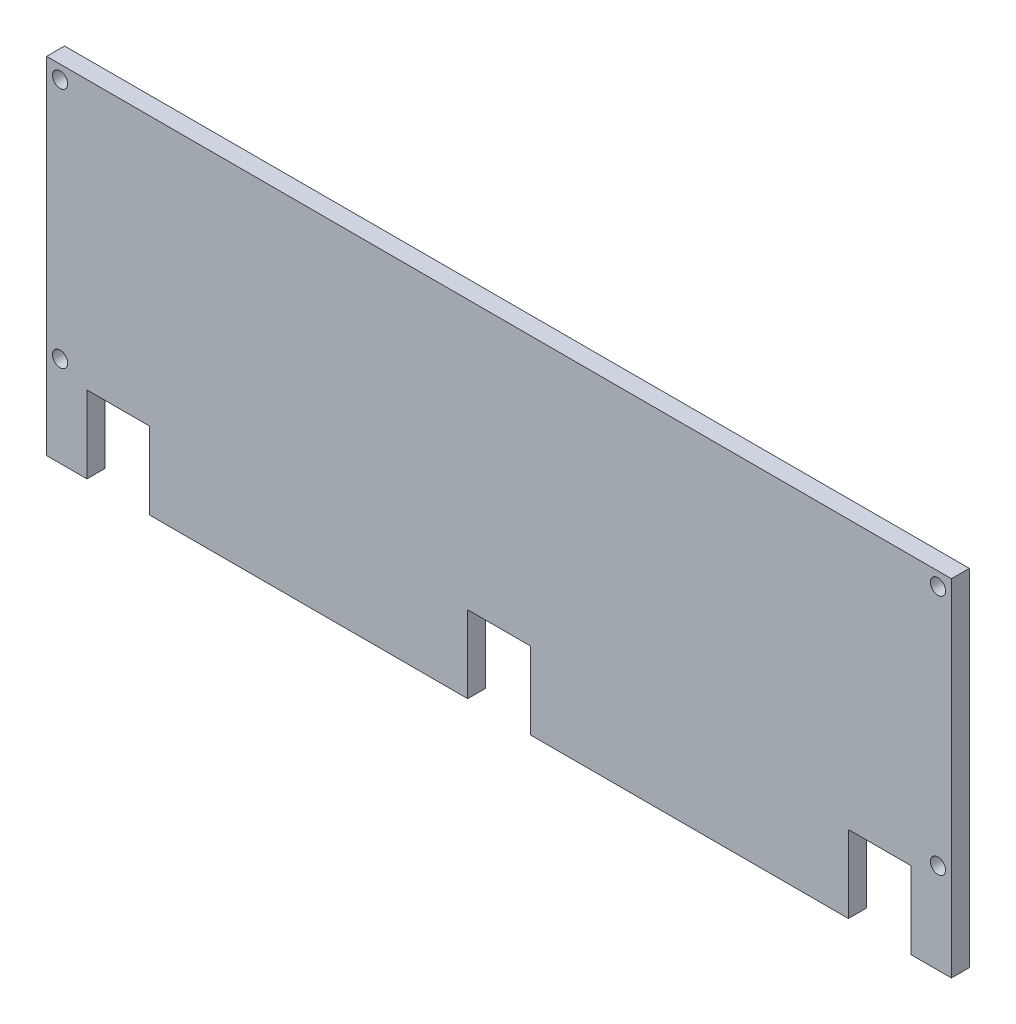
ISO-10303-21;
HEADER;
FILE_DESCRIPTION(('STEP AP214'),'2;1');
FILE_NAME('part.step','',(''),(''),'','','');
FILE_SCHEMA(('AUTOMOTIVE_DESIGN { 1 0 10303 214 1 1 1 1 }'));
ENDSEC;
DATA;
#1=APPLICATION_CONTEXT('core data for automotive mechanical design processes');
#2=APPLICATION_PROTOCOL_DEFINITION('international standard','automotive_design',2000,#1);
#3=PRODUCT_CONTEXT('',#1,'mechanical');
#4=PRODUCT('Part','Part','',(#3));
#5=PRODUCT_RELATED_PRODUCT_CATEGORY('part','',(#4));
#6=PRODUCT_DEFINITION_FORMATION('','',#4);
#7=PRODUCT_DEFINITION_CONTEXT('part definition',#1,'design');
#8=PRODUCT_DEFINITION('design','',#6,#7);
#9=PRODUCT_DEFINITION_SHAPE('','',#8);
#10=(LENGTH_UNIT() NAMED_UNIT(*) SI_UNIT(.MILLI.,.METRE.));
#11=(NAMED_UNIT(*) PLANE_ANGLE_UNIT() SI_UNIT($,.RADIAN.));
#12=(NAMED_UNIT(*) SI_UNIT($,.STERADIAN.) SOLID_ANGLE_UNIT());
#13=UNCERTAINTY_MEASURE_WITH_UNIT(LENGTH_MEASURE(1.E-05),#10,'distance_accuracy_value','');
#14=(GEOMETRIC_REPRESENTATION_CONTEXT(3) GLOBAL_UNCERTAINTY_ASSIGNED_CONTEXT((#13)) GLOBAL_UNIT_ASSIGNED_CONTEXT((#10,
#11,#12)) REPRESENTATION_CONTEXT('',''));
#15=CARTESIAN_POINT('',(0.,0.,0.));
#16=DIRECTION('',(0.,0.,1.));
#17=DIRECTION('',(1.,0.,0.));
#18=AXIS2_PLACEMENT_3D('',#15,#16,#17);
#19=CARTESIAN_POINT('',(-252.5,-75.,-10.));
#20=DIRECTION('',(0.,-1.,0.));
#21=DIRECTION('',(0.,0.,-1.));
#22=AXIS2_PLACEMENT_3D('',#19,#20,#21);
#23=PLANE('',#22);
#24=DIRECTION('',(0.,0.,1.));
#25=VECTOR('',#24,1.);
#26=CARTESIAN_POINT('',(17.5000000000002,-75.,-10.));
#27=LINE('',#26,#25);
#28=CARTESIAN_POINT('',(17.5000000000002,-75.,-10.));
#29=VERTEX_POINT('',#28);
#30=CARTESIAN_POINT('',(17.5000000000002,-75.,0.));
#31=VERTEX_POINT('',#30);
#32=EDGE_CURVE('E201',#29,#31,#27,.T.);
#33=ORIENTED_EDGE('',*,*,#32,.T.);
#34=DIRECTION('',(1.,0.,0.));
#35=VECTOR('',#34,1.);
#36=CARTESIAN_POINT('',(-252.5,-75.,0.));
#37=LINE('',#36,#35);
#38=CARTESIAN_POINT('',(-17.4999999999998,-75.,0.));
#39=VERTEX_POINT('',#38);
#40=EDGE_CURVE('E298',#39,#31,#37,.T.);
#41=ORIENTED_EDGE('',*,*,#40,.F.);
#42=DIRECTION('',(0.,0.,1.));
#43=VECTOR('',#42,1.);
#44=CARTESIAN_POINT('',(-17.4999999999998,-75.,-10.));
#45=LINE('',#44,#43);
#46=CARTESIAN_POINT('',(-17.4999999999998,-75.,-10.));
#47=VERTEX_POINT('',#46);
#48=EDGE_CURVE('E228',#47,#39,#45,.T.);
#49=ORIENTED_EDGE('',*,*,#48,.F.);
#50=DIRECTION('',(1.,0.,0.));
#51=VECTOR('',#50,1.);
#52=CARTESIAN_POINT('',(-252.5,-75.,-10.));
#53=LINE('',#52,#51);
#54=EDGE_CURVE('E288',#47,#29,#53,.T.);
#55=ORIENTED_EDGE('',*,*,#54,.T.);
#56=EDGE_LOOP('',(#33,#41,#49,#55));
#57=FACE_BOUND('',#56,.T.);
#58=ADVANCED_FACE('F38',(#57),#23,.T.);
#59=DIRECTION('',(0.,0.,1.));
#60=VECTOR('',#59,1.);
#61=CARTESIAN_POINT('',(-195.,-75.,-10.));
#62=LINE('',#61,#60);
#63=CARTESIAN_POINT('',(-195.,-75.,-10.));
#64=VERTEX_POINT('',#63);
#65=CARTESIAN_POINT('',(-195.,-75.,0.));
#66=VERTEX_POINT('',#65);
#67=EDGE_CURVE('E224',#64,#66,#62,.T.);
#68=ORIENTED_EDGE('',*,*,#67,.T.);
#69=CARTESIAN_POINT('',(-230.,-75.,0.));
#70=VERTEX_POINT('',#69);
#71=EDGE_CURVE('E279',#70,#66,#37,.T.);
#72=ORIENTED_EDGE('',*,*,#71,.F.);
#73=DIRECTION('',(0.,0.,1.));
#74=VECTOR('',#73,1.);
#75=CARTESIAN_POINT('',(-230.,-75.,-10.));
#76=LINE('',#75,#74);
#77=CARTESIAN_POINT('',(-230.,-75.,-10.));
#78=VERTEX_POINT('',#77);
#79=EDGE_CURVE('E245',#78,#70,#76,.T.);
#80=ORIENTED_EDGE('',*,*,#79,.F.);
#81=EDGE_CURVE('E285',#78,#64,#53,.T.);
#82=ORIENTED_EDGE('',*,*,#81,.T.);
#83=EDGE_LOOP('',(#68,#72,#80,#82));
#84=FACE_BOUND('',#83,.T.);
#85=ADVANCED_FACE('F332',(#84),#23,.T.);
#86=CARTESIAN_POINT('',(252.5,75.,-10.));
#87=DIRECTION('',(1.,0.,0.));
#88=DIRECTION('',(0.,0.,-1.));
#89=AXIS2_PLACEMENT_3D('',#86,#87,#88);
#90=PLANE('',#89);
#91=DIRECTION('',(0.,1.,0.));
#92=VECTOR('',#91,1.);
#93=CARTESIAN_POINT('',(252.5,75.,0.));
#94=LINE('',#93,#92);
#95=CARTESIAN_POINT('',(252.5,-118.000000000013,0.));
#96=VERTEX_POINT('',#95);
#97=CARTESIAN_POINT('',(252.5,75.,0.));
#98=VERTEX_POINT('',#97);
#99=EDGE_CURVE('E274',#96,#98,#94,.T.);
#100=ORIENTED_EDGE('',*,*,#99,.F.);
#101=DIRECTION('',(0.,0.,1.));
#102=VECTOR('',#101,1.);
#103=CARTESIAN_POINT('',(252.5,-118.000000000013,-10.));
#104=LINE('',#103,#102);
#105=CARTESIAN_POINT('',(252.5,-118.000000000013,-10.));
#106=VERTEX_POINT('',#105);
#107=EDGE_CURVE('E163',#106,#96,#104,.T.);
#108=ORIENTED_EDGE('',*,*,#107,.F.);
#109=DIRECTION('',(0.,1.,0.));
#110=VECTOR('',#109,1.);
#111=CARTESIAN_POINT('',(252.5,75.,-10.));
#112=LINE('',#111,#110);
#113=CARTESIAN_POINT('',(252.5,75.,-10.));
#114=VERTEX_POINT('',#113);
#115=EDGE_CURVE('E173',#106,#114,#112,.T.);
#116=ORIENTED_EDGE('',*,*,#115,.T.);
#117=DIRECTION('',(0.,0.,1.));
#118=VECTOR('',#117,1.);
#119=CARTESIAN_POINT('',(252.5,75.,-10.));
#120=LINE('',#119,#118);
#121=EDGE_CURVE('E42',#114,#98,#120,.T.);
#122=ORIENTED_EDGE('',*,*,#121,.T.);
#123=EDGE_LOOP('',(#100,#108,#116,#122));
#124=FACE_BOUND('',#123,.T.);
#125=ADVANCED_FACE('F40',(#124),#90,.T.);
#126=DIRECTION('',(0.,0.,1.));
#127=VECTOR('',#126,1.);
#128=CARTESIAN_POINT('',(230.,-75.000000000013,-10.));
#129=LINE('',#128,#127);
#130=CARTESIAN_POINT('',(230.,-75.000000000013,-10.));
#131=VERTEX_POINT('',#130);
#132=CARTESIAN_POINT('',(230.,-75.000000000013,0.));
#133=VERTEX_POINT('',#132);
#134=EDGE_CURVE('E178',#131,#133,#129,.T.);
#135=ORIENTED_EDGE('',*,*,#134,.T.);
#136=CARTESIAN_POINT('',(195.,-75.,0.));
#137=VERTEX_POINT('',#136);
#138=EDGE_CURVE('E296',#137,#133,#37,.T.);
#139=ORIENTED_EDGE('',*,*,#138,.F.);
#140=DIRECTION('',(0.,0.,1.));
#141=VECTOR('',#140,1.);
#142=CARTESIAN_POINT('',(195.,-75.,-10.));
#143=LINE('',#142,#141);
#144=CARTESIAN_POINT('',(195.,-75.,-10.));
#145=VERTEX_POINT('',#144);
#146=EDGE_CURVE('E205',#145,#137,#143,.T.);
#147=ORIENTED_EDGE('',*,*,#146,.F.);
#148=EDGE_CURVE('E284',#145,#131,#53,.T.);
#149=ORIENTED_EDGE('',*,*,#148,.T.);
#150=EDGE_LOOP('',(#135,#139,#147,#149));
#151=FACE_BOUND('',#150,.T.);
#152=ADVANCED_FACE('F303',(#151),#23,.T.);
#153=CARTESIAN_POINT('',(-252.5,75.,-10.));
#154=DIRECTION('',(-1.,0.,0.));
#155=DIRECTION('',(0.,0.,1.));
#156=AXIS2_PLACEMENT_3D('',#153,#154,#155);
#157=PLANE('',#156);
#158=DIRECTION('',(0.,-1.,0.));
#159=VECTOR('',#158,1.);
#160=CARTESIAN_POINT('',(-252.5,75.,0.));
#161=LINE('',#160,#159);
#162=CARTESIAN_POINT('',(-252.5,75.,0.));
#163=VERTEX_POINT('',#162);
#164=CARTESIAN_POINT('',(-252.5,-118.,0.));
#165=VERTEX_POINT('',#164);
#166=EDGE_CURVE('E294',#163,#165,#161,.T.);
#167=ORIENTED_EDGE('',*,*,#166,.F.);
#168=DIRECTION('',(0.,0.,1.));
#169=VECTOR('',#168,1.);
#170=CARTESIAN_POINT('',(-252.5,75.,-10.));
#171=LINE('',#170,#169);
#172=CARTESIAN_POINT('',(-252.5,75.,-10.));
#173=VERTEX_POINT('',#172);
#174=EDGE_CURVE('E11',#173,#163,#171,.T.);
#175=ORIENTED_EDGE('',*,*,#174,.F.);
#176=DIRECTION('',(0.,-1.,0.));
#177=VECTOR('',#176,1.);
#178=CARTESIAN_POINT('',(-252.5,75.,-10.));
#179=LINE('',#178,#177);
#180=CARTESIAN_POINT('',(-252.5,-118.,-10.));
#181=VERTEX_POINT('',#180);
#182=EDGE_CURVE('E282',#173,#181,#179,.T.);
#183=ORIENTED_EDGE('',*,*,#182,.T.);
#184=DIRECTION('',(0.,0.,1.));
#185=VECTOR('',#184,1.);
#186=CARTESIAN_POINT('',(-252.5,-118.,-10.));
#187=LINE('',#186,#185);
#188=EDGE_CURVE('E240',#181,#165,#187,.T.);
#189=ORIENTED_EDGE('',*,*,#188,.T.);
#190=EDGE_LOOP('',(#167,#175,#183,#189));
#191=FACE_BOUND('',#190,.T.);
#192=ADVANCED_FACE('F341',(#191),#157,.T.);
#193=CARTESIAN_POINT('',(-252.5,75.,-10.));
#194=DIRECTION('',(0.,1.,0.));
#195=DIRECTION('',(0.,0.,1.));
#196=AXIS2_PLACEMENT_3D('',#193,#194,#195);
#197=PLANE('',#196);
#198=DIRECTION('',(-1.,0.,0.));
#199=VECTOR('',#198,1.);
#200=CARTESIAN_POINT('',(-252.5,75.,0.));
#201=LINE('',#200,#199);
#202=EDGE_CURVE('E291',#98,#163,#201,.T.);
#203=ORIENTED_EDGE('',*,*,#202,.F.);
#204=ORIENTED_EDGE('',*,*,#121,.F.);
#205=DIRECTION('',(-1.,0.,0.));
#206=VECTOR('',#205,1.);
#207=CARTESIAN_POINT('',(-252.5,75.,-10.));
#208=LINE('',#207,#206);
#209=EDGE_CURVE('E278',#114,#173,#208,.T.);
#210=ORIENTED_EDGE('',*,*,#209,.T.);
#211=ORIENTED_EDGE('',*,*,#174,.T.);
#212=EDGE_LOOP('',(#203,#204,#210,#211));
#213=FACE_BOUND('',#212,.T.);
#214=ADVANCED_FACE('F346',(#213),#197,.T.);
#215=CARTESIAN_POINT('',(0.,0.,-10.));
#216=DIRECTION('',(0.,0.,1.));
#217=DIRECTION('',(1.,0.,0.));
#218=AXIS2_PLACEMENT_3D('',#215,#216,#217);
#219=PLANE('',#218);
#220=CARTESIAN_POINT('',(244.999999999999,67.4999999999999,-10.));
#221=DIRECTION('',(0.,0.,-1.));
#222=DIRECTION('',(1.,0.,0.));
#223=AXIS2_PLACEMENT_3D('',#220,#221,#222);
#224=CIRCLE('',#223,4.25000000000001);
#225=CARTESIAN_POINT('',(249.249999999999,67.4999999999999,-10.));
#226=VERTEX_POINT('',#225);
#227=EDGE_CURVE('E248',#226,#226,#224,.T.);
#228=ORIENTED_EDGE('',*,*,#227,.F.);
#229=EDGE_LOOP('',(#228));
#230=FACE_BOUND('',#229,.T.);
#231=CARTESIAN_POINT('',(-244.999999999999,67.4999999999999,-10.));
#232=DIRECTION('',(0.,0.,1.));
#233=DIRECTION('',(-1.,0.,0.));
#234=AXIS2_PLACEMENT_3D('',#231,#232,#233);
#235=CIRCLE('',#234,4.25000000000001);
#236=CARTESIAN_POINT('',(-249.249999999999,67.4999999999999,-10.));
#237=VERTEX_POINT('',#236);
#238=EDGE_CURVE('E256',#237,#237,#235,.T.);
#239=ORIENTED_EDGE('',*,*,#238,.T.);
#240=EDGE_LOOP('',(#239));
#241=FACE_BOUND('',#240,.T.);
#242=CARTESIAN_POINT('',(244.999999999999,-67.4999999999999,-10.));
#243=DIRECTION('',(0.,0.,1.));
#244=DIRECTION('',(1.,0.,0.));
#245=AXIS2_PLACEMENT_3D('',#242,#243,#244);
#246=CIRCLE('',#245,4.25000000000001);
#247=CARTESIAN_POINT('',(249.249999999999,-67.4999999999999,-10.));
#248=VERTEX_POINT('',#247);
#249=EDGE_CURVE('E262',#248,#248,#246,.T.);
#250=ORIENTED_EDGE('',*,*,#249,.T.);
#251=EDGE_LOOP('',(#250));
#252=FACE_BOUND('',#251,.T.);
#253=CARTESIAN_POINT('',(-244.999999999999,-67.4999999999999,-10.));
#254=DIRECTION('',(0.,0.,-1.));
#255=DIRECTION('',(-1.,0.,0.));
#256=AXIS2_PLACEMENT_3D('',#253,#254,#255);
#257=CIRCLE('',#256,4.25000000000001);
#258=CARTESIAN_POINT('',(-249.249999999999,-67.4999999999999,-10.));
#259=VERTEX_POINT('',#258);
#260=EDGE_CURVE('E268',#259,#259,#257,.T.);
#261=ORIENTED_EDGE('',*,*,#260,.F.);
#262=EDGE_LOOP('',(#261));
#263=FACE_BOUND('',#262,.T.);
#264=ORIENTED_EDGE('',*,*,#115,.F.);
#265=DIRECTION('',(1.,0.,0.));
#266=VECTOR('',#265,1.);
#267=CARTESIAN_POINT('',(230.,-118.000000000013,-10.));
#268=LINE('',#267,#266);
#269=CARTESIAN_POINT('',(230.,-118.000000000013,-10.));
#270=VERTEX_POINT('',#269);
#271=EDGE_CURVE('E157',#270,#106,#268,.T.);
#272=ORIENTED_EDGE('',*,*,#271,.F.);
#273=DIRECTION('',(0.,-1.,0.));
#274=VECTOR('',#273,1.);
#275=CARTESIAN_POINT('',(230.,-75.000000000013,-10.));
#276=LINE('',#275,#274);
#277=EDGE_CURVE('E169',#131,#270,#276,.T.);
#278=ORIENTED_EDGE('',*,*,#277,.F.);
#279=ORIENTED_EDGE('',*,*,#148,.F.);
#280=DIRECTION('',(0.,1.,0.));
#281=VECTOR('',#280,1.);
#282=CARTESIAN_POINT('',(195.,-75.,-10.));
#283=LINE('',#282,#281);
#284=CARTESIAN_POINT('',(195.,-118.,-10.));
#285=VERTEX_POINT('',#284);
#286=EDGE_CURVE('E193',#285,#145,#283,.T.);
#287=ORIENTED_EDGE('',*,*,#286,.F.);
#288=DIRECTION('',(1.,0.,0.));
#289=VECTOR('',#288,1.);
#290=CARTESIAN_POINT('',(17.5000000000002,-118.,-10.));
#291=LINE('',#290,#289);
#292=CARTESIAN_POINT('',(17.5000000000002,-118.,-10.));
#293=VERTEX_POINT('',#292);
#294=EDGE_CURVE('E190',#293,#285,#291,.T.);
#295=ORIENTED_EDGE('',*,*,#294,.F.);
#296=DIRECTION('',(0.,-1.,0.));
#297=VECTOR('',#296,1.);
#298=CARTESIAN_POINT('',(17.5000000000002,-75.,-10.));
#299=LINE('',#298,#297);
#300=EDGE_CURVE('E187',#29,#293,#299,.T.);
#301=ORIENTED_EDGE('',*,*,#300,.F.);
#302=ORIENTED_EDGE('',*,*,#54,.F.);
#303=DIRECTION('',(0.,1.,0.));
#304=VECTOR('',#303,1.);
#305=CARTESIAN_POINT('',(-17.4999999999998,-75.,-10.));
#306=LINE('',#305,#304);
#307=CARTESIAN_POINT('',(-17.4999999999998,-118.,-10.));
#308=VERTEX_POINT('',#307);
#309=EDGE_CURVE('E216',#308,#47,#306,.T.);
#310=ORIENTED_EDGE('',*,*,#309,.F.);
#311=DIRECTION('',(1.,0.,0.));
#312=VECTOR('',#311,1.);
#313=CARTESIAN_POINT('',(-195.,-118.,-10.));
#314=LINE('',#313,#312);
#315=CARTESIAN_POINT('',(-195.,-118.,-10.));
#316=VERTEX_POINT('',#315);
#317=EDGE_CURVE('E213',#316,#308,#314,.T.);
#318=ORIENTED_EDGE('',*,*,#317,.F.);
#319=DIRECTION('',(0.,-1.,0.));
#320=VECTOR('',#319,1.);
#321=CARTESIAN_POINT('',(-195.,-75.,-10.));
#322=LINE('',#321,#320);
#323=EDGE_CURVE('E210',#64,#316,#322,.T.);
#324=ORIENTED_EDGE('',*,*,#323,.F.);
#325=ORIENTED_EDGE('',*,*,#81,.F.);
#326=DIRECTION('',(0.,1.,0.));
#327=VECTOR('',#326,1.);
#328=CARTESIAN_POINT('',(-230.,-75.,-10.));
#329=LINE('',#328,#327);
#330=CARTESIAN_POINT('',(-230.,-118.,-10.));
#331=VERTEX_POINT('',#330);
#332=EDGE_CURVE('E236',#331,#78,#329,.T.);
#333=ORIENTED_EDGE('',*,*,#332,.F.);
#334=DIRECTION('',(1.,0.,0.));
#335=VECTOR('',#334,1.);
#336=CARTESIAN_POINT('',(-252.5,-118.,-10.));
#337=LINE('',#336,#335);
#338=EDGE_CURVE('E233',#181,#331,#337,.T.);
#339=ORIENTED_EDGE('',*,*,#338,.F.);
#340=ORIENTED_EDGE('',*,*,#182,.F.);
#341=ORIENTED_EDGE('',*,*,#209,.F.);
#342=EDGE_LOOP('',(#264,#272,#278,#279,#287,#295,#301,#302,#310,#318,#324,#325,#333,#339,#340,#341));
#343=FACE_BOUND('',#342,.T.);
#344=ADVANCED_FACE('F167',(#230,#241,#252,#263,#343),#219,.F.);
#345=CARTESIAN_POINT('',(0.,0.,0.));
#346=DIRECTION('',(0.,0.,1.));
#347=DIRECTION('',(1.,0.,0.));
#348=AXIS2_PLACEMENT_3D('',#345,#346,#347);
#349=PLANE('',#348);
#350=CARTESIAN_POINT('',(244.999999999999,67.4999999999999,0.));
#351=DIRECTION('',(0.,0.,-1.));
#352=DIRECTION('',(1.,0.,0.));
#353=AXIS2_PLACEMENT_3D('',#350,#351,#352);
#354=CIRCLE('',#353,4.25000000000001);
#355=CARTESIAN_POINT('',(249.249999999999,67.4999999999999,0.));
#356=VERTEX_POINT('',#355);
#357=EDGE_CURVE('E253',#356,#356,#354,.T.);
#358=ORIENTED_EDGE('',*,*,#357,.T.);
#359=EDGE_LOOP('',(#358));
#360=FACE_BOUND('',#359,.T.);
#361=CARTESIAN_POINT('',(-244.999999999999,67.4999999999999,0.));
#362=DIRECTION('',(0.,0.,1.));
#363=DIRECTION('',(-1.,0.,0.));
#364=AXIS2_PLACEMENT_3D('',#361,#362,#363);
#365=CIRCLE('',#364,4.25000000000001);
#366=CARTESIAN_POINT('',(-249.249999999999,67.4999999999999,0.));
#367=VERTEX_POINT('',#366);
#368=EDGE_CURVE('E259',#367,#367,#365,.T.);
#369=ORIENTED_EDGE('',*,*,#368,.F.);
#370=EDGE_LOOP('',(#369));
#371=FACE_BOUND('',#370,.T.);
#372=CARTESIAN_POINT('',(244.999999999999,-67.4999999999999,0.));
#373=DIRECTION('',(0.,0.,1.));
#374=DIRECTION('',(1.,0.,0.));
#375=AXIS2_PLACEMENT_3D('',#372,#373,#374);
#376=CIRCLE('',#375,4.25000000000001);
#377=CARTESIAN_POINT('',(249.249999999999,-67.4999999999999,0.));
#378=VERTEX_POINT('',#377);
#379=EDGE_CURVE('E265',#378,#378,#376,.T.);
#380=ORIENTED_EDGE('',*,*,#379,.F.);
#381=EDGE_LOOP('',(#380));
#382=FACE_BOUND('',#381,.T.);
#383=CARTESIAN_POINT('',(-244.999999999999,-67.4999999999999,0.));
#384=DIRECTION('',(0.,0.,-1.));
#385=DIRECTION('',(-1.,0.,0.));
#386=AXIS2_PLACEMENT_3D('',#383,#384,#385);
#387=CIRCLE('',#386,4.25000000000001);
#388=CARTESIAN_POINT('',(-249.249999999999,-67.4999999999999,0.));
#389=VERTEX_POINT('',#388);
#390=EDGE_CURVE('E271',#389,#389,#387,.T.);
#391=ORIENTED_EDGE('',*,*,#390,.T.);
#392=EDGE_LOOP('',(#391));
#393=FACE_BOUND('',#392,.T.);
#394=ORIENTED_EDGE('',*,*,#99,.T.);
#395=ORIENTED_EDGE('',*,*,#202,.T.);
#396=ORIENTED_EDGE('',*,*,#166,.T.);
#397=DIRECTION('',(1.,0.,0.));
#398=VECTOR('',#397,1.);
#399=CARTESIAN_POINT('',(-252.5,-118.,0.));
#400=LINE('',#399,#398);
#401=CARTESIAN_POINT('',(-230.,-118.,0.));
#402=VERTEX_POINT('',#401);
#403=EDGE_CURVE('E227',#165,#402,#400,.T.);
#404=ORIENTED_EDGE('',*,*,#403,.T.);
#405=DIRECTION('',(0.,1.,0.));
#406=VECTOR('',#405,1.);
#407=CARTESIAN_POINT('',(-230.,-75.,0.));
#408=LINE('',#407,#406);
#409=EDGE_CURVE('E237',#402,#70,#408,.T.);
#410=ORIENTED_EDGE('',*,*,#409,.T.);
#411=ORIENTED_EDGE('',*,*,#71,.T.);
#412=DIRECTION('',(0.,-1.,0.));
#413=VECTOR('',#412,1.);
#414=CARTESIAN_POINT('',(-195.,-75.,0.));
#415=LINE('',#414,#413);
#416=CARTESIAN_POINT('',(-195.,-118.,0.));
#417=VERTEX_POINT('',#416);
#418=EDGE_CURVE('E204',#66,#417,#415,.T.);
#419=ORIENTED_EDGE('',*,*,#418,.T.);
#420=DIRECTION('',(1.,0.,0.));
#421=VECTOR('',#420,1.);
#422=CARTESIAN_POINT('',(-195.,-118.,0.));
#423=LINE('',#422,#421);
#424=CARTESIAN_POINT('',(-17.4999999999998,-118.,0.));
#425=VERTEX_POINT('',#424);
#426=EDGE_CURVE('E221',#417,#425,#423,.T.);
#427=ORIENTED_EDGE('',*,*,#426,.T.);
#428=DIRECTION('',(0.,1.,0.));
#429=VECTOR('',#428,1.);
#430=CARTESIAN_POINT('',(-17.4999999999998,-75.,0.));
#431=LINE('',#430,#429);
#432=EDGE_CURVE('E60',#425,#39,#431,.T.);
#433=ORIENTED_EDGE('',*,*,#432,.T.);
#434=ORIENTED_EDGE('',*,*,#40,.T.);
#435=DIRECTION('',(0.,-1.,0.));
#436=VECTOR('',#435,1.);
#437=CARTESIAN_POINT('',(17.5000000000002,-75.,0.));
#438=LINE('',#437,#436);
#439=CARTESIAN_POINT('',(17.5000000000002,-118.,0.));
#440=VERTEX_POINT('',#439);
#441=EDGE_CURVE('E185',#31,#440,#438,.T.);
#442=ORIENTED_EDGE('',*,*,#441,.T.);
#443=DIRECTION('',(1.,0.,0.));
#444=VECTOR('',#443,1.);
#445=CARTESIAN_POINT('',(17.5000000000002,-118.,0.));
#446=LINE('',#445,#444);
#447=CARTESIAN_POINT('',(195.,-118.,0.));
#448=VERTEX_POINT('',#447);
#449=EDGE_CURVE('E198',#440,#448,#446,.T.);
#450=ORIENTED_EDGE('',*,*,#449,.T.);
#451=DIRECTION('',(0.,1.,0.));
#452=VECTOR('',#451,1.);
#453=CARTESIAN_POINT('',(195.,-75.,0.));
#454=LINE('',#453,#452);
#455=EDGE_CURVE('E53',#448,#137,#454,.T.);
#456=ORIENTED_EDGE('',*,*,#455,.T.);
#457=ORIENTED_EDGE('',*,*,#138,.T.);
#458=DIRECTION('',(0.,-1.,0.));
#459=VECTOR('',#458,1.);
#460=CARTESIAN_POINT('',(230.,-75.000000000013,0.));
#461=LINE('',#460,#459);
#462=CARTESIAN_POINT('',(230.,-118.000000000013,0.));
#463=VERTEX_POINT('',#462);
#464=EDGE_CURVE('E180',#133,#463,#461,.T.);
#465=ORIENTED_EDGE('',*,*,#464,.T.);
#466=DIRECTION('',(1.,0.,0.));
#467=VECTOR('',#466,1.);
#468=CARTESIAN_POINT('',(230.,-118.000000000013,0.));
#469=LINE('',#468,#467);
#470=EDGE_CURVE('E159',#463,#96,#469,.T.);
#471=ORIENTED_EDGE('',*,*,#470,.T.);
#472=EDGE_LOOP('',(#394,#395,#396,#404,#410,#411,#419,#427,#433,#434,#442,#450,#456,#457,#465,#471));
#473=FACE_BOUND('',#472,.T.);
#474=ADVANCED_FACE('F300',(#360,#371,#382,#393,#473),#349,.T.);
#475=CARTESIAN_POINT('',(-244.999999999999,-67.4999999999999,0.));
#476=DIRECTION('',(0.,0.,-1.));
#477=DIRECTION('',(-1.,0.,0.));
#478=AXIS2_PLACEMENT_3D('',#475,#476,#477);
#479=CYLINDRICAL_SURFACE('',#478,4.25000000000001);
#480=ORIENTED_EDGE('',*,*,#390,.F.);
#481=EDGE_LOOP('',(#480));
#482=FACE_BOUND('',#481,.T.);
#483=ORIENTED_EDGE('',*,*,#260,.T.);
#484=EDGE_LOOP('',(#483));
#485=FACE_BOUND('',#484,.T.);
#486=ADVANCED_FACE('F396',(#482,#485),#479,.F.);
#487=CARTESIAN_POINT('',(244.999999999999,-67.4999999999999,0.));
#488=DIRECTION('',(0.,0.,-1.));
#489=DIRECTION('',(-1.,0.,0.));
#490=AXIS2_PLACEMENT_3D('',#487,#488,#489);
#491=CYLINDRICAL_SURFACE('',#490,4.25000000000001);
#492=ORIENTED_EDGE('',*,*,#379,.T.);
#493=EDGE_LOOP('',(#492));
#494=FACE_BOUND('',#493,.T.);
#495=ORIENTED_EDGE('',*,*,#249,.F.);
#496=EDGE_LOOP('',(#495));
#497=FACE_BOUND('',#496,.T.);
#498=ADVANCED_FACE('F392',(#494,#497),#491,.F.);
#499=CARTESIAN_POINT('',(-244.999999999999,67.4999999999999,0.));
#500=DIRECTION('',(0.,0.,-1.));
#501=DIRECTION('',(-1.,0.,0.));
#502=AXIS2_PLACEMENT_3D('',#499,#500,#501);
#503=CYLINDRICAL_SURFACE('',#502,4.25000000000001);
#504=ORIENTED_EDGE('',*,*,#368,.T.);
#505=EDGE_LOOP('',(#504));
#506=FACE_BOUND('',#505,.T.);
#507=ORIENTED_EDGE('',*,*,#238,.F.);
#508=EDGE_LOOP('',(#507));
#509=FACE_BOUND('',#508,.T.);
#510=ADVANCED_FACE('F388',(#506,#509),#503,.F.);
#511=CARTESIAN_POINT('',(244.999999999999,67.4999999999999,0.));
#512=DIRECTION('',(0.,0.,-1.));
#513=DIRECTION('',(-1.,0.,0.));
#514=AXIS2_PLACEMENT_3D('',#511,#512,#513);
#515=CYLINDRICAL_SURFACE('',#514,4.25000000000001);
#516=ORIENTED_EDGE('',*,*,#357,.F.);
#517=EDGE_LOOP('',(#516));
#518=FACE_BOUND('',#517,.T.);
#519=ORIENTED_EDGE('',*,*,#227,.T.);
#520=EDGE_LOOP('',(#519));
#521=FACE_BOUND('',#520,.T.);
#522=ADVANCED_FACE('F383',(#518,#521),#515,.F.);
#523=CARTESIAN_POINT('',(-230.,-75.,-10.));
#524=DIRECTION('',(1.,0.,0.));
#525=DIRECTION('',(0.,0.,-1.));
#526=AXIS2_PLACEMENT_3D('',#523,#524,#525);
#527=PLANE('',#526);
#528=ORIENTED_EDGE('',*,*,#409,.F.);
#529=DIRECTION('',(0.,0.,1.));
#530=VECTOR('',#529,1.);
#531=CARTESIAN_POINT('',(-230.,-118.,-10.));
#532=LINE('',#531,#530);
#533=EDGE_CURVE('E249',#331,#402,#532,.T.);
#534=ORIENTED_EDGE('',*,*,#533,.F.);
#535=ORIENTED_EDGE('',*,*,#332,.T.);
#536=ORIENTED_EDGE('',*,*,#79,.T.);
#537=EDGE_LOOP('',(#528,#534,#535,#536));
#538=FACE_BOUND('',#537,.T.);
#539=ADVANCED_FACE('F362',(#538),#527,.T.);
#540=CARTESIAN_POINT('',(-252.5,-118.,-10.));
#541=DIRECTION('',(0.,-1.,0.));
#542=DIRECTION('',(0.,0.,-1.));
#543=AXIS2_PLACEMENT_3D('',#540,#541,#542);
#544=PLANE('',#543);
#545=ORIENTED_EDGE('',*,*,#403,.F.);
#546=ORIENTED_EDGE('',*,*,#188,.F.);
#547=ORIENTED_EDGE('',*,*,#338,.T.);
#548=ORIENTED_EDGE('',*,*,#533,.T.);
#549=EDGE_LOOP('',(#545,#546,#547,#548));
#550=FACE_BOUND('',#549,.T.);
#551=ADVANCED_FACE('F359',(#550),#544,.T.);
#552=CARTESIAN_POINT('',(-195.,-75.,-10.));
#553=DIRECTION('',(-1.,0.,0.));
#554=DIRECTION('',(0.,-1.,0.));
#555=AXIS2_PLACEMENT_3D('',#552,#553,#554);
#556=PLANE('',#555);
#557=ORIENTED_EDGE('',*,*,#418,.F.);
#558=ORIENTED_EDGE('',*,*,#67,.F.);
#559=ORIENTED_EDGE('',*,*,#323,.T.);
#560=DIRECTION('',(0.,0.,1.));
#561=VECTOR('',#560,1.);
#562=CARTESIAN_POINT('',(-195.,-118.,-10.));
#563=LINE('',#562,#561);
#564=EDGE_CURVE('E218',#316,#417,#563,.T.);
#565=ORIENTED_EDGE('',*,*,#564,.T.);
#566=EDGE_LOOP('',(#557,#558,#559,#565));
#567=FACE_BOUND('',#566,.T.);
#568=ADVANCED_FACE('F367',(#567),#556,.T.);
#569=CARTESIAN_POINT('',(-17.4999999999998,-75.,-10.));
#570=DIRECTION('',(1.,0.,0.));
#571=DIRECTION('',(0.,1.,0.));
#572=AXIS2_PLACEMENT_3D('',#569,#570,#571);
#573=PLANE('',#572);
#574=ORIENTED_EDGE('',*,*,#432,.F.);
#575=DIRECTION('',(0.,0.,1.));
#576=VECTOR('',#575,1.);
#577=CARTESIAN_POINT('',(-17.4999999999998,-118.,-10.));
#578=LINE('',#577,#576);
#579=EDGE_CURVE('E230',#308,#425,#578,.T.);
#580=ORIENTED_EDGE('',*,*,#579,.F.);
#581=ORIENTED_EDGE('',*,*,#309,.T.);
#582=ORIENTED_EDGE('',*,*,#48,.T.);
#583=EDGE_LOOP('',(#574,#580,#581,#582));
#584=FACE_BOUND('',#583,.T.);
#585=ADVANCED_FACE('F371',(#584),#573,.T.);
#586=CARTESIAN_POINT('',(-195.,-118.,-10.));
#587=DIRECTION('',(0.,-1.,0.));
#588=DIRECTION('',(0.,0.,-1.));
#589=AXIS2_PLACEMENT_3D('',#586,#587,#588);
#590=PLANE('',#589);
#591=ORIENTED_EDGE('',*,*,#426,.F.);
#592=ORIENTED_EDGE('',*,*,#564,.F.);
#593=ORIENTED_EDGE('',*,*,#317,.T.);
#594=ORIENTED_EDGE('',*,*,#579,.T.);
#595=EDGE_LOOP('',(#591,#592,#593,#594));
#596=FACE_BOUND('',#595,.T.);
#597=ADVANCED_FACE('F328',(#596),#590,.T.);
#598=CARTESIAN_POINT('',(17.5000000000002,-75.,-10.));
#599=DIRECTION('',(-1.,0.,0.));
#600=DIRECTION('',(0.,-1.,0.));
#601=AXIS2_PLACEMENT_3D('',#598,#599,#600);
#602=PLANE('',#601);
#603=ORIENTED_EDGE('',*,*,#441,.F.);
#604=ORIENTED_EDGE('',*,*,#32,.F.);
#605=ORIENTED_EDGE('',*,*,#300,.T.);
#606=DIRECTION('',(0.,0.,1.));
#607=VECTOR('',#606,1.);
#608=CARTESIAN_POINT('',(17.5000000000002,-118.,-10.));
#609=LINE('',#608,#607);
#610=EDGE_CURVE('E195',#293,#440,#609,.T.);
#611=ORIENTED_EDGE('',*,*,#610,.T.);
#612=EDGE_LOOP('',(#603,#604,#605,#611));
#613=FACE_BOUND('',#612,.T.);
#614=ADVANCED_FACE('F315',(#613),#602,.T.);
#615=CARTESIAN_POINT('',(195.,-75.,-10.));
#616=DIRECTION('',(1.,0.,0.));
#617=DIRECTION('',(0.,0.,-1.));
#618=AXIS2_PLACEMENT_3D('',#615,#616,#617);
#619=PLANE('',#618);
#620=ORIENTED_EDGE('',*,*,#455,.F.);
#621=DIRECTION('',(0.,0.,1.));
#622=VECTOR('',#621,1.);
#623=CARTESIAN_POINT('',(195.,-118.,-10.));
#624=LINE('',#623,#622);
#625=EDGE_CURVE('E207',#285,#448,#624,.T.);
#626=ORIENTED_EDGE('',*,*,#625,.F.);
#627=ORIENTED_EDGE('',*,*,#286,.T.);
#628=ORIENTED_EDGE('',*,*,#146,.T.);
#629=EDGE_LOOP('',(#620,#626,#627,#628));
#630=FACE_BOUND('',#629,.T.);
#631=ADVANCED_FACE('F320',(#630),#619,.T.);
#632=CARTESIAN_POINT('',(17.5000000000002,-118.,-10.));
#633=DIRECTION('',(0.,-1.,0.));
#634=DIRECTION('',(0.,0.,-1.));
#635=AXIS2_PLACEMENT_3D('',#632,#633,#634);
#636=PLANE('',#635);
#637=ORIENTED_EDGE('',*,*,#449,.F.);
#638=ORIENTED_EDGE('',*,*,#610,.F.);
#639=ORIENTED_EDGE('',*,*,#294,.T.);
#640=ORIENTED_EDGE('',*,*,#625,.T.);
#641=EDGE_LOOP('',(#637,#638,#639,#640));
#642=FACE_BOUND('',#641,.T.);
#643=ADVANCED_FACE('F318',(#642),#636,.T.);
#644=CARTESIAN_POINT('',(230.,-75.000000000013,-10.));
#645=DIRECTION('',(-1.,0.,0.));
#646=DIRECTION('',(0.,0.,1.));
#647=AXIS2_PLACEMENT_3D('',#644,#645,#646);
#648=PLANE('',#647);
#649=ORIENTED_EDGE('',*,*,#464,.F.);
#650=ORIENTED_EDGE('',*,*,#134,.F.);
#651=ORIENTED_EDGE('',*,*,#277,.T.);
#652=DIRECTION('',(0.,0.,1.));
#653=VECTOR('',#652,1.);
#654=CARTESIAN_POINT('',(230.,-118.000000000013,-10.));
#655=LINE('',#654,#653);
#656=EDGE_CURVE('E153',#270,#463,#655,.T.);
#657=ORIENTED_EDGE('',*,*,#656,.T.);
#658=EDGE_LOOP('',(#649,#650,#651,#657));
#659=FACE_BOUND('',#658,.T.);
#660=ADVANCED_FACE('F176',(#659),#648,.T.);
#661=CARTESIAN_POINT('',(230.,-118.000000000013,-10.));
#662=DIRECTION('',(0.,-1.,0.));
#663=DIRECTION('',(0.,0.,-1.));
#664=AXIS2_PLACEMENT_3D('',#661,#662,#663);
#665=PLANE('',#664);
#666=ORIENTED_EDGE('',*,*,#470,.F.);
#667=ORIENTED_EDGE('',*,*,#656,.F.);
#668=ORIENTED_EDGE('',*,*,#271,.T.);
#669=ORIENTED_EDGE('',*,*,#107,.T.);
#670=EDGE_LOOP('',(#666,#667,#668,#669));
#671=FACE_BOUND('',#670,.T.);
#672=ADVANCED_FACE('F155',(#671),#665,.T.);
#673=CLOSED_SHELL('',(#58,#85,#125,#152,#192,#214,#344,#474,#486,#498,#510,#522,#539,#551,#568,
#585,#597,#614,#631,#643,#660,#672));
#674=MANIFOLD_SOLID_BREP('B2',#673);
#675=ADVANCED_BREP_SHAPE_REPRESENTATION('',(#18,#674),#14);
#676=SHAPE_DEFINITION_REPRESENTATION(#9,#675);
ENDSEC;
END-ISO-10303-21;
